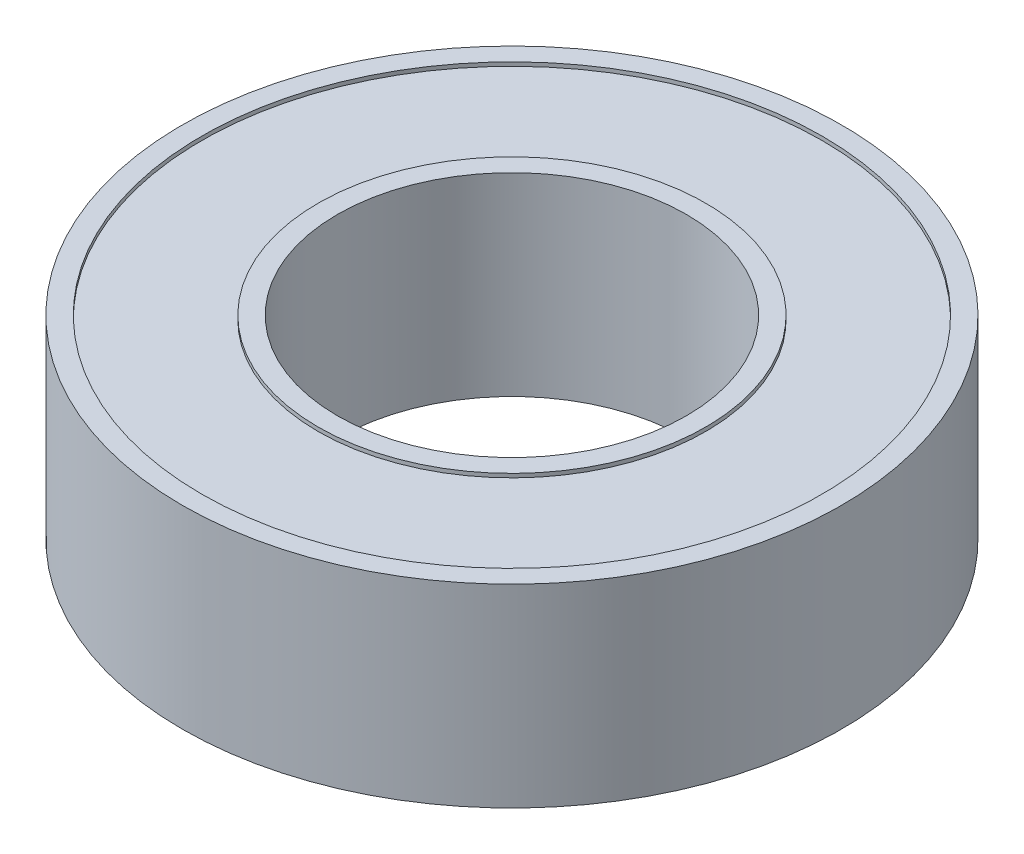
ISO-10303-21;
HEADER;
FILE_DESCRIPTION(('STEP AP214'),'2;1');
FILE_NAME('part.step','',(''),(''),'','','');
FILE_SCHEMA(('AUTOMOTIVE_DESIGN { 1 0 10303 214 1 1 1 1 }'));
ENDSEC;
DATA;
#1=APPLICATION_CONTEXT('core data for automotive mechanical design processes');
#2=APPLICATION_PROTOCOL_DEFINITION('international standard','automotive_design',2000,#1);
#3=PRODUCT_CONTEXT('',#1,'mechanical');
#4=PRODUCT('Part','Part','',(#3));
#5=PRODUCT_RELATED_PRODUCT_CATEGORY('part','',(#4));
#6=PRODUCT_DEFINITION_FORMATION('','',#4);
#7=PRODUCT_DEFINITION_CONTEXT('part definition',#1,'design');
#8=PRODUCT_DEFINITION('design','',#6,#7);
#9=PRODUCT_DEFINITION_SHAPE('','',#8);
#10=(LENGTH_UNIT() NAMED_UNIT(*) SI_UNIT(.MILLI.,.METRE.));
#11=(NAMED_UNIT(*) PLANE_ANGLE_UNIT() SI_UNIT($,.RADIAN.));
#12=(NAMED_UNIT(*) SI_UNIT($,.STERADIAN.) SOLID_ANGLE_UNIT());
#13=UNCERTAINTY_MEASURE_WITH_UNIT(LENGTH_MEASURE(1.E-05),#10,'distance_accuracy_value','');
#14=(GEOMETRIC_REPRESENTATION_CONTEXT(3) GLOBAL_UNCERTAINTY_ASSIGNED_CONTEXT((#13)) GLOBAL_UNIT_ASSIGNED_CONTEXT((#10,
#11,#12)) REPRESENTATION_CONTEXT('',''));
#15=CARTESIAN_POINT('',(0.,0.,0.));
#16=DIRECTION('',(0.,0.,1.));
#17=DIRECTION('',(1.,0.,0.));
#18=AXIS2_PLACEMENT_3D('',#15,#16,#17);
#19=CARTESIAN_POINT('',(0.,-2.5,0.));
#20=DIRECTION('',(0.,1.,0.));
#21=DIRECTION('',(0.,0.,1.));
#22=AXIS2_PLACEMENT_3D('',#19,#20,#21);
#23=PLANE('',#22);
#24=CARTESIAN_POINT('',(0.,-2.5,0.));
#25=DIRECTION('',(0.,1.,0.));
#26=DIRECTION('',(0.,0.,1.));
#27=AXIS2_PLACEMENT_3D('',#24,#25,#26);
#28=CIRCLE('',#27,4.5);
#29=CARTESIAN_POINT('',(0.,-2.5,4.5));
#30=VERTEX_POINT('',#29);
#31=EDGE_CURVE('E55',#30,#30,#28,.T.);
#32=ORIENTED_EDGE('',*,*,#31,.T.);
#33=EDGE_LOOP('',(#32));
#34=FACE_BOUND('',#33,.T.);
#35=CARTESIAN_POINT('',(0.,-2.5,0.));
#36=DIRECTION('',(0.,1.,0.));
#37=DIRECTION('',(0.,0.,1.));
#38=AXIS2_PLACEMENT_3D('',#35,#36,#37);
#39=CIRCLE('',#38,5.);
#40=CARTESIAN_POINT('',(0.,-2.5,5.));
#41=VERTEX_POINT('',#40);
#42=EDGE_CURVE('E84',#41,#41,#39,.T.);
#43=ORIENTED_EDGE('',*,*,#42,.F.);
#44=EDGE_LOOP('',(#43));
#45=FACE_BOUND('',#44,.T.);
#46=ADVANCED_FACE('F40',(#34,#45),#23,.F.);
#47=CARTESIAN_POINT('',(0.,2.5,0.));
#48=DIRECTION('',(0.,1.,0.));
#49=DIRECTION('',(0.,0.,1.));
#50=AXIS2_PLACEMENT_3D('',#47,#48,#49);
#51=PLANE('',#50);
#52=CARTESIAN_POINT('',(0.,2.5,0.));
#53=DIRECTION('',(0.,1.,0.));
#54=DIRECTION('',(0.,0.,1.));
#55=AXIS2_PLACEMENT_3D('',#52,#53,#54);
#56=CIRCLE('',#55,4.5);
#57=CARTESIAN_POINT('',(0.,2.5,4.5));
#58=VERTEX_POINT('',#57);
#59=EDGE_CURVE('E53',#58,#58,#56,.T.);
#60=ORIENTED_EDGE('',*,*,#59,.F.);
#61=EDGE_LOOP('',(#60));
#62=FACE_BOUND('',#61,.T.);
#63=CARTESIAN_POINT('',(0.,2.5,0.));
#64=DIRECTION('',(0.,1.,0.));
#65=DIRECTION('',(0.,0.,1.));
#66=AXIS2_PLACEMENT_3D('',#63,#64,#65);
#67=CIRCLE('',#66,5.);
#68=CARTESIAN_POINT('',(0.,2.5,5.));
#69=VERTEX_POINT('',#68);
#70=EDGE_CURVE('E68',#69,#69,#67,.T.);
#71=ORIENTED_EDGE('',*,*,#70,.T.);
#72=EDGE_LOOP('',(#71));
#73=FACE_BOUND('',#72,.T.);
#74=ADVANCED_FACE('F107',(#62,#73),#51,.T.);
#75=CARTESIAN_POINT('',(0.,2.5,0.));
#76=DIRECTION('',(0.,1.,0.));
#77=DIRECTION('',(0.,0.,1.));
#78=AXIS2_PLACEMENT_3D('',#75,#76,#77);
#79=CIRCLE('',#78,8.);
#80=CARTESIAN_POINT('',(0.,2.5,8.));
#81=VERTEX_POINT('',#80);
#82=EDGE_CURVE('E63',#81,#81,#79,.T.);
#83=ORIENTED_EDGE('',*,*,#82,.F.);
#84=EDGE_LOOP('',(#83));
#85=FACE_BOUND('',#84,.T.);
#86=CARTESIAN_POINT('',(0.,2.5,0.));
#87=DIRECTION('',(0.,1.,0.));
#88=DIRECTION('',(0.,0.,1.));
#89=AXIS2_PLACEMENT_3D('',#86,#87,#88);
#90=CIRCLE('',#89,8.5);
#91=CARTESIAN_POINT('',(0.,2.5,8.5));
#92=VERTEX_POINT('',#91);
#93=EDGE_CURVE('E10',#92,#92,#90,.T.);
#94=ORIENTED_EDGE('',*,*,#93,.T.);
#95=EDGE_LOOP('',(#94));
#96=FACE_BOUND('',#95,.T.);
#97=ADVANCED_FACE('F113',(#85,#96),#51,.T.);
#98=CARTESIAN_POINT('',(0.,-2.5,0.));
#99=DIRECTION('',(0.,1.,0.));
#100=DIRECTION('',(0.,0.,1.));
#101=AXIS2_PLACEMENT_3D('',#98,#99,#100);
#102=CIRCLE('',#101,8.);
#103=CARTESIAN_POINT('',(0.,-2.5,8.));
#104=VERTEX_POINT('',#103);
#105=EDGE_CURVE('E79',#104,#104,#102,.T.);
#106=ORIENTED_EDGE('',*,*,#105,.T.);
#107=EDGE_LOOP('',(#106));
#108=FACE_BOUND('',#107,.T.);
#109=CARTESIAN_POINT('',(0.,-2.5,0.));
#110=DIRECTION('',(0.,1.,0.));
#111=DIRECTION('',(0.,0.,1.));
#112=AXIS2_PLACEMENT_3D('',#109,#110,#111);
#113=CIRCLE('',#112,8.5);
#114=CARTESIAN_POINT('',(0.,-2.5,8.5));
#115=VERTEX_POINT('',#114);
#116=EDGE_CURVE('E44',#115,#115,#113,.T.);
#117=ORIENTED_EDGE('',*,*,#116,.F.);
#118=EDGE_LOOP('',(#117));
#119=FACE_BOUND('',#118,.T.);
#120=ADVANCED_FACE('F109',(#108,#119),#23,.F.);
#121=CARTESIAN_POINT('',(0.,2.5,0.));
#122=DIRECTION('',(0.,-1.,0.));
#123=DIRECTION('',(0.,0.,-1.));
#124=AXIS2_PLACEMENT_3D('',#121,#122,#123);
#125=CYLINDRICAL_SURFACE('',#124,8.5);
#126=ORIENTED_EDGE('',*,*,#93,.F.);
#127=EDGE_LOOP('',(#126));
#128=FACE_BOUND('',#127,.T.);
#129=ORIENTED_EDGE('',*,*,#116,.T.);
#130=EDGE_LOOP('',(#129));
#131=FACE_BOUND('',#130,.T.);
#132=ADVANCED_FACE('F42',(#128,#131),#125,.T.);
#133=CARTESIAN_POINT('',(0.,2.5,0.));
#134=DIRECTION('',(0.,-1.,0.));
#135=DIRECTION('',(0.,0.,-1.));
#136=AXIS2_PLACEMENT_3D('',#133,#134,#135);
#137=CYLINDRICAL_SURFACE('',#136,4.5);
#138=ORIENTED_EDGE('',*,*,#59,.T.);
#139=EDGE_LOOP('',(#138));
#140=FACE_BOUND('',#139,.T.);
#141=ORIENTED_EDGE('',*,*,#31,.F.);
#142=EDGE_LOOP('',(#141));
#143=FACE_BOUND('',#142,.T.);
#144=ADVANCED_FACE('F122',(#140,#143),#137,.F.);
#145=CARTESIAN_POINT('',(0.,2.4,0.));
#146=DIRECTION('',(0.,1.,0.));
#147=DIRECTION('',(0.,0.,1.));
#148=AXIS2_PLACEMENT_3D('',#145,#146,#147);
#149=CYLINDRICAL_SURFACE('',#148,5.);
#150=CARTESIAN_POINT('',(0.,2.4,0.));
#151=DIRECTION('',(0.,1.,0.));
#152=DIRECTION('',(0.,0.,1.));
#153=AXIS2_PLACEMENT_3D('',#150,#151,#152);
#154=CIRCLE('',#153,5.);
#155=CARTESIAN_POINT('',(0.,2.4,5.));
#156=VERTEX_POINT('',#155);
#157=EDGE_CURVE('E67',#156,#156,#154,.T.);
#158=ORIENTED_EDGE('',*,*,#157,.T.);
#159=EDGE_LOOP('',(#158));
#160=FACE_BOUND('',#159,.T.);
#161=ORIENTED_EDGE('',*,*,#70,.F.);
#162=EDGE_LOOP('',(#161));
#163=FACE_BOUND('',#162,.T.);
#164=ADVANCED_FACE('F144',(#160,#163),#149,.T.);
#165=CARTESIAN_POINT('',(0.,2.4,0.));
#166=DIRECTION('',(0.,1.,0.));
#167=DIRECTION('',(0.,0.,1.));
#168=AXIS2_PLACEMENT_3D('',#165,#166,#167);
#169=CYLINDRICAL_SURFACE('',#168,8.);
#170=CARTESIAN_POINT('',(0.,2.4,0.));
#171=DIRECTION('',(0.,1.,0.));
#172=DIRECTION('',(0.,0.,1.));
#173=AXIS2_PLACEMENT_3D('',#170,#171,#172);
#174=CIRCLE('',#173,8.);
#175=CARTESIAN_POINT('',(0.,2.4,8.));
#176=VERTEX_POINT('',#175);
#177=EDGE_CURVE('E59',#176,#176,#174,.T.);
#178=ORIENTED_EDGE('',*,*,#177,.F.);
#179=EDGE_LOOP('',(#178));
#180=FACE_BOUND('',#179,.T.);
#181=ORIENTED_EDGE('',*,*,#82,.T.);
#182=EDGE_LOOP('',(#181));
#183=FACE_BOUND('',#182,.T.);
#184=ADVANCED_FACE('F140',(#180,#183),#169,.F.);
#185=CARTESIAN_POINT('',(0.,2.4,0.));
#186=DIRECTION('',(0.,1.,0.));
#187=DIRECTION('',(0.,0.,1.));
#188=AXIS2_PLACEMENT_3D('',#185,#186,#187);
#189=PLANE('',#188);
#190=ORIENTED_EDGE('',*,*,#157,.F.);
#191=EDGE_LOOP('',(#190));
#192=FACE_BOUND('',#191,.T.);
#193=ORIENTED_EDGE('',*,*,#177,.T.);
#194=EDGE_LOOP('',(#193));
#195=FACE_BOUND('',#194,.T.);
#196=ADVANCED_FACE('F102',(#192,#195),#189,.T.);
#197=CARTESIAN_POINT('',(0.,-2.4,0.));
#198=DIRECTION('',(0.,-1.,0.));
#199=DIRECTION('',(0.,0.,-1.));
#200=AXIS2_PLACEMENT_3D('',#197,#198,#199);
#201=CYLINDRICAL_SURFACE('',#200,5.);
#202=CARTESIAN_POINT('',(0.,-2.4,0.));
#203=DIRECTION('',(0.,1.,0.));
#204=DIRECTION('',(0.,0.,1.));
#205=AXIS2_PLACEMENT_3D('',#202,#203,#204);
#206=CIRCLE('',#205,5.);
#207=CARTESIAN_POINT('',(0.,-2.4,5.));
#208=VERTEX_POINT('',#207);
#209=EDGE_CURVE('E83',#208,#208,#206,.T.);
#210=ORIENTED_EDGE('',*,*,#209,.F.);
#211=EDGE_LOOP('',(#210));
#212=FACE_BOUND('',#211,.T.);
#213=ORIENTED_EDGE('',*,*,#42,.T.);
#214=EDGE_LOOP('',(#213));
#215=FACE_BOUND('',#214,.T.);
#216=ADVANCED_FACE('F98',(#212,#215),#201,.T.);
#217=CARTESIAN_POINT('',(0.,-2.4,0.));
#218=DIRECTION('',(0.,-1.,0.));
#219=DIRECTION('',(0.,0.,-1.));
#220=AXIS2_PLACEMENT_3D('',#217,#218,#219);
#221=CYLINDRICAL_SURFACE('',#220,8.);
#222=CARTESIAN_POINT('',(0.,-2.4,0.));
#223=DIRECTION('',(0.,1.,0.));
#224=DIRECTION('',(0.,0.,1.));
#225=AXIS2_PLACEMENT_3D('',#222,#223,#224);
#226=CIRCLE('',#225,8.);
#227=CARTESIAN_POINT('',(0.,-2.4,8.));
#228=VERTEX_POINT('',#227);
#229=EDGE_CURVE('E72',#228,#228,#226,.T.);
#230=ORIENTED_EDGE('',*,*,#229,.T.);
#231=EDGE_LOOP('',(#230));
#232=FACE_BOUND('',#231,.T.);
#233=ORIENTED_EDGE('',*,*,#105,.F.);
#234=EDGE_LOOP('',(#233));
#235=FACE_BOUND('',#234,.T.);
#236=ADVANCED_FACE('F101',(#232,#235),#221,.F.);
#237=CARTESIAN_POINT('',(0.,-2.4,0.));
#238=DIRECTION('',(0.,-1.,0.));
#239=DIRECTION('',(0.,0.,1.));
#240=AXIS2_PLACEMENT_3D('',#237,#238,#239);
#241=PLANE('',#240);
#242=ORIENTED_EDGE('',*,*,#209,.T.);
#243=EDGE_LOOP('',(#242));
#244=FACE_BOUND('',#243,.T.);
#245=ORIENTED_EDGE('',*,*,#229,.F.);
#246=EDGE_LOOP('',(#245));
#247=FACE_BOUND('',#246,.T.);
#248=ADVANCED_FACE('F95',(#244,#247),#241,.T.);
#249=CLOSED_SHELL('',(#46,#74,#97,#120,#132,#144,#164,#184,#196,#216,#236,#248));
#250=MANIFOLD_SOLID_BREP('B2',#249);
#251=ADVANCED_BREP_SHAPE_REPRESENTATION('',(#18,#250),#14);
#252=SHAPE_DEFINITION_REPRESENTATION(#9,#251);
ENDSEC;
END-ISO-10303-21;
